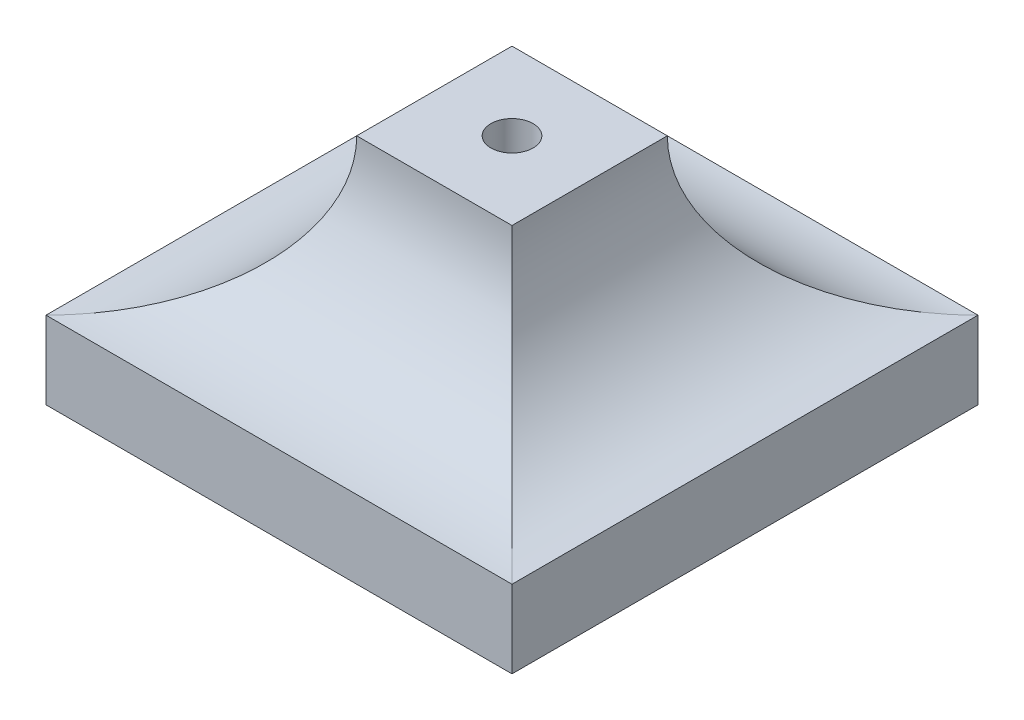
ISO-10303-21;
HEADER;
FILE_DESCRIPTION(('STEP AP214'),'2;1');
FILE_NAME('part.step','',(''),(''),'','','');
FILE_SCHEMA(('AUTOMOTIVE_DESIGN { 1 0 10303 214 1 1 1 1 }'));
ENDSEC;
DATA;
#1=APPLICATION_CONTEXT('core data for automotive mechanical design processes');
#2=APPLICATION_PROTOCOL_DEFINITION('international standard','automotive_design',2000,#1);
#3=PRODUCT_CONTEXT('',#1,'mechanical');
#4=PRODUCT('Part','Part','',(#3));
#5=PRODUCT_RELATED_PRODUCT_CATEGORY('part','',(#4));
#6=PRODUCT_DEFINITION_FORMATION('','',#4);
#7=PRODUCT_DEFINITION_CONTEXT('part definition',#1,'design');
#8=PRODUCT_DEFINITION('design','',#6,#7);
#9=PRODUCT_DEFINITION_SHAPE('','',#8);
#10=(LENGTH_UNIT() NAMED_UNIT(*) SI_UNIT(.MILLI.,.METRE.));
#11=(NAMED_UNIT(*) PLANE_ANGLE_UNIT() SI_UNIT($,.RADIAN.));
#12=(NAMED_UNIT(*) SI_UNIT($,.STERADIAN.) SOLID_ANGLE_UNIT());
#13=UNCERTAINTY_MEASURE_WITH_UNIT(LENGTH_MEASURE(1.E-05),#10,'distance_accuracy_value','');
#14=(GEOMETRIC_REPRESENTATION_CONTEXT(3) GLOBAL_UNCERTAINTY_ASSIGNED_CONTEXT((#13)) GLOBAL_UNIT_ASSIGNED_CONTEXT((#10,
#11,#12)) REPRESENTATION_CONTEXT('',''));
#15=CARTESIAN_POINT('',(0.,0.,0.));
#16=DIRECTION('',(0.,0.,1.));
#17=DIRECTION('',(1.,0.,0.));
#18=AXIS2_PLACEMENT_3D('',#15,#16,#17);
#19=CARTESIAN_POINT('',(0.,19.0499998008095,0.));
#20=DIRECTION('',(0.,1.,0.));
#21=DIRECTION('',(0.,0.,1.));
#22=AXIS2_PLACEMENT_3D('',#19,#20,#21);
#23=CYLINDRICAL_SURFACE('',#22,1.7272);
#24=CARTESIAN_POINT('',(0.,19.0499998008095,0.));
#25=DIRECTION('',(0.,1.,0.));
#26=DIRECTION('',(0.,0.,1.));
#27=AXIS2_PLACEMENT_3D('',#24,#25,#26);
#28=CIRCLE('',#27,1.7272);
#29=CARTESIAN_POINT('',(0.,19.0499998008095,1.7272));
#30=VERTEX_POINT('',#29);
#31=EDGE_CURVE('E127',#30,#30,#28,.T.);
#32=ORIENTED_EDGE('',*,*,#31,.T.);
#33=EDGE_LOOP('',(#32));
#34=FACE_BOUND('',#33,.T.);
#35=CARTESIAN_POINT('',(0.,6.35,0.));
#36=DIRECTION('',(0.,-1.,0.));
#37=DIRECTION('',(0.,0.,-1.));
#38=AXIS2_PLACEMENT_3D('',#35,#36,#37);
#39=CIRCLE('',#38,1.7272);
#40=CARTESIAN_POINT('',(0.,6.35,-1.7272));
#41=VERTEX_POINT('',#40);
#42=EDGE_CURVE('E38',#41,#41,#39,.F.);
#43=ORIENTED_EDGE('',*,*,#42,.F.);
#44=EDGE_LOOP('',(#43));
#45=FACE_BOUND('',#44,.T.);
#46=ADVANCED_FACE('F34',(#34,#45),#23,.F.);
#47=CARTESIAN_POINT('',(19.05,6.35,-19.05));
#48=DIRECTION('',(-1.,0.,0.));
#49=DIRECTION('',(0.,0.,1.));
#50=AXIS2_PLACEMENT_3D('',#47,#48,#49);
#51=PLANE('',#50);
#52=DIRECTION('',(0.,0.,-1.));
#53=VECTOR('',#52,1.);
#54=CARTESIAN_POINT('',(19.05,0.,-19.05));
#55=LINE('',#54,#53);
#56=CARTESIAN_POINT('',(19.05,0.,19.05));
#57=VERTEX_POINT('',#56);
#58=CARTESIAN_POINT('',(19.05,0.,-19.05));
#59=VERTEX_POINT('',#58);
#60=EDGE_CURVE('E100',#57,#59,#55,.T.);
#61=ORIENTED_EDGE('',*,*,#60,.T.);
#62=DIRECTION('',(0.,-1.,0.));
#63=VECTOR('',#62,1.);
#64=CARTESIAN_POINT('',(19.05,6.35,-19.05));
#65=LINE('',#64,#63);
#66=CARTESIAN_POINT('',(19.05,6.35,-19.05));
#67=VERTEX_POINT('',#66);
#68=EDGE_CURVE('E110',#67,#59,#65,.T.);
#69=ORIENTED_EDGE('',*,*,#68,.F.);
#70=DIRECTION('',(0.,0.,-1.));
#71=VECTOR('',#70,1.);
#72=CARTESIAN_POINT('',(19.05,6.35,-19.05));
#73=LINE('',#72,#71);
#74=CARTESIAN_POINT('',(19.05,6.35,19.05));
#75=VERTEX_POINT('',#74);
#76=EDGE_CURVE('E101',#75,#67,#73,.T.);
#77=ORIENTED_EDGE('',*,*,#76,.F.);
#78=DIRECTION('',(0.,-1.,0.));
#79=VECTOR('',#78,1.);
#80=CARTESIAN_POINT('',(19.05,6.35,19.05));
#81=LINE('',#80,#79);
#82=EDGE_CURVE('E95',#75,#57,#81,.T.);
#83=ORIENTED_EDGE('',*,*,#82,.T.);
#84=EDGE_LOOP('',(#61,#69,#77,#83));
#85=FACE_BOUND('',#84,.T.);
#86=ADVANCED_FACE('F36',(#85),#51,.F.);
#87=CARTESIAN_POINT('',(-19.05,6.35,-19.05));
#88=DIRECTION('',(0.,0.,1.));
#89=DIRECTION('',(1.,0.,0.));
#90=AXIS2_PLACEMENT_3D('',#87,#88,#89);
#91=PLANE('',#90);
#92=DIRECTION('',(0.,-1.,0.));
#93=VECTOR('',#92,1.);
#94=CARTESIAN_POINT('',(-19.05,6.35,-19.05));
#95=LINE('',#94,#93);
#96=CARTESIAN_POINT('',(-19.05,6.35,-19.05));
#97=VERTEX_POINT('',#96);
#98=CARTESIAN_POINT('',(-19.05,0.,-19.05));
#99=VERTEX_POINT('',#98);
#100=EDGE_CURVE('E85',#97,#99,#95,.T.);
#101=ORIENTED_EDGE('',*,*,#100,.F.);
#102=DIRECTION('',(1.,0.,0.));
#103=VECTOR('',#102,1.);
#104=CARTESIAN_POINT('',(-19.05,6.35,-19.05));
#105=LINE('',#104,#103);
#106=EDGE_CURVE('E118',#97,#67,#105,.T.);
#107=ORIENTED_EDGE('',*,*,#106,.T.);
#108=ORIENTED_EDGE('',*,*,#68,.T.);
#109=DIRECTION('',(-1.,0.,0.));
#110=VECTOR('',#109,1.);
#111=CARTESIAN_POINT('',(-19.05,0.,-19.05));
#112=LINE('',#111,#110);
#113=EDGE_CURVE('E89',#59,#99,#112,.T.);
#114=ORIENTED_EDGE('',*,*,#113,.T.);
#115=EDGE_LOOP('',(#101,#107,#108,#114));
#116=FACE_BOUND('',#115,.T.);
#117=ADVANCED_FACE('F126',(#116),#91,.F.);
#118=CARTESIAN_POINT('',(-19.05,6.35,-19.05));
#119=DIRECTION('',(1.,0.,0.));
#120=DIRECTION('',(0.,0.,-1.));
#121=AXIS2_PLACEMENT_3D('',#118,#119,#120);
#122=PLANE('',#121);
#123=DIRECTION('',(0.,0.,1.));
#124=VECTOR('',#123,1.);
#125=CARTESIAN_POINT('',(-19.05,0.,-19.05));
#126=LINE('',#125,#124);
#127=CARTESIAN_POINT('',(-19.05,0.,19.05));
#128=VERTEX_POINT('',#127);
#129=EDGE_CURVE('E77',#99,#128,#126,.T.);
#130=ORIENTED_EDGE('',*,*,#129,.T.);
#131=DIRECTION('',(0.,-1.,0.));
#132=VECTOR('',#131,1.);
#133=CARTESIAN_POINT('',(-19.05,6.35,19.05));
#134=LINE('',#133,#132);
#135=CARTESIAN_POINT('',(-19.05,6.35,19.05));
#136=VERTEX_POINT('',#135);
#137=EDGE_CURVE('E82',#136,#128,#134,.T.);
#138=ORIENTED_EDGE('',*,*,#137,.F.);
#139=DIRECTION('',(0.,0.,1.));
#140=VECTOR('',#139,1.);
#141=CARTESIAN_POINT('',(-19.05,6.35,-19.05));
#142=LINE('',#141,#140);
#143=EDGE_CURVE('E104',#97,#136,#142,.T.);
#144=ORIENTED_EDGE('',*,*,#143,.F.);
#145=ORIENTED_EDGE('',*,*,#100,.T.);
#146=EDGE_LOOP('',(#130,#138,#144,#145));
#147=FACE_BOUND('',#146,.T.);
#148=ADVANCED_FACE('F79',(#147),#122,.F.);
#149=CARTESIAN_POINT('',(-19.05,6.35,19.05));
#150=DIRECTION('',(0.,0.,-1.));
#151=DIRECTION('',(-1.,0.,0.));
#152=AXIS2_PLACEMENT_3D('',#149,#150,#151);
#153=PLANE('',#152);
#154=ORIENTED_EDGE('',*,*,#82,.F.);
#155=DIRECTION('',(1.,0.,0.));
#156=VECTOR('',#155,1.);
#157=CARTESIAN_POINT('',(-19.05,6.35,19.05));
#158=LINE('',#157,#156);
#159=EDGE_CURVE('E58',#136,#75,#158,.T.);
#160=ORIENTED_EDGE('',*,*,#159,.F.);
#161=ORIENTED_EDGE('',*,*,#137,.T.);
#162=DIRECTION('',(1.,0.,0.));
#163=VECTOR('',#162,1.);
#164=CARTESIAN_POINT('',(-19.05,0.,19.05));
#165=LINE('',#164,#163);
#166=EDGE_CURVE('E88',#128,#57,#165,.T.);
#167=ORIENTED_EDGE('',*,*,#166,.T.);
#168=EDGE_LOOP('',(#154,#160,#161,#167));
#169=FACE_BOUND('',#168,.T.);
#170=ADVANCED_FACE('F93',(#169),#153,.F.);
#171=CARTESIAN_POINT('',(0.,0.,0.));
#172=DIRECTION('',(0.,1.,0.));
#173=DIRECTION('',(0.,0.,1.));
#174=AXIS2_PLACEMENT_3D('',#171,#172,#173);
#175=PLANE('',#174);
#176=CARTESIAN_POINT('',(0.,0.,0.));
#177=DIRECTION('',(0.,-1.,0.));
#178=DIRECTION('',(0.,0.,-1.));
#179=AXIS2_PLACEMENT_3D('',#176,#177,#178);
#180=CIRCLE('',#179,3.96875);
#181=CARTESIAN_POINT('',(0.,0.,-3.96875));
#182=VERTEX_POINT('',#181);
#183=EDGE_CURVE('E285',#182,#182,#180,.T.);
#184=ORIENTED_EDGE('',*,*,#183,.F.);
#185=EDGE_LOOP('',(#184));
#186=FACE_BOUND('',#185,.T.);
#187=ORIENTED_EDGE('',*,*,#60,.F.);
#188=ORIENTED_EDGE('',*,*,#166,.F.);
#189=ORIENTED_EDGE('',*,*,#129,.F.);
#190=ORIENTED_EDGE('',*,*,#113,.F.);
#191=EDGE_LOOP('',(#187,#188,#189,#190));
#192=FACE_BOUND('',#191,.T.);
#193=ADVANCED_FACE('F98',(#186,#192),#175,.F.);
#194=CARTESIAN_POINT('',(-19.05,19.0499998008095,-59.2109262211489));
#195=DIRECTION('',(0.,0.,1.));
#196=DIRECTION('',(1.,0.,0.));
#197=AXIS2_PLACEMENT_3D('',#194,#195,#196);
#198=CYLINDRICAL_SURFACE('',#197,12.6999998008095);
#199=CARTESIAN_POINT('',(-19.05,19.0499998008095,19.05));
#200=DIRECTION('',(0.707106781186548,0.,0.707106781186547));
#201=DIRECTION('',(-0.707106781186547,0.,0.707106781186547));
#202=AXIS2_PLACEMENT_3D('',#199,#200,#201);
#203=ELLIPSE('',#202,17.9605119604404,12.6999998008095);
#204=CARTESIAN_POINT('',(-6.35000019919047,19.0499998008095,6.35000019919048));
#205=VERTEX_POINT('',#204);
#206=EDGE_CURVE('E151',#205,#136,#203,.F.);
#207=ORIENTED_EDGE('',*,*,#206,.F.);
#208=DIRECTION('',(0.,0.,1.));
#209=VECTOR('',#208,1.);
#210=CARTESIAN_POINT('',(-6.35000019919047,19.0499998008095,-59.2109262211489));
#211=LINE('',#210,#209);
#212=CARTESIAN_POINT('',(-6.35000019919047,19.0499998008095,-6.35000019919048));
#213=VERTEX_POINT('',#212);
#214=EDGE_CURVE('E143',#213,#205,#211,.T.);
#215=ORIENTED_EDGE('',*,*,#214,.F.);
#216=CARTESIAN_POINT('',(-19.05,19.0499998008095,-19.05));
#217=DIRECTION('',(-0.707106781186547,0.,0.707106781186547));
#218=DIRECTION('',(0.707106781186548,0.,0.707106781186547));
#219=AXIS2_PLACEMENT_3D('',#216,#217,#218);
#220=ELLIPSE('',#219,17.9605119604404,12.6999998008095);
#221=EDGE_CURVE('E145',#97,#213,#220,.T.);
#222=ORIENTED_EDGE('',*,*,#221,.F.);
#223=ORIENTED_EDGE('',*,*,#143,.T.);
#224=EDGE_LOOP('',(#207,#215,#222,#223));
#225=FACE_BOUND('',#224,.T.);
#226=ADVANCED_FACE('F157',(#225),#198,.F.);
#227=CARTESIAN_POINT('',(-6.35000019919047,19.0499998008095,-59.2109262211489));
#228=DIRECTION('',(0.,1.,0.));
#229=DIRECTION('',(0.,0.,1.));
#230=AXIS2_PLACEMENT_3D('',#227,#228,#229);
#231=PLANE('',#230);
#232=ORIENTED_EDGE('',*,*,#31,.F.);
#233=EDGE_LOOP('',(#232));
#234=FACE_BOUND('',#233,.T.);
#235=DIRECTION('',(1.,0.,0.));
#236=VECTOR('',#235,1.);
#237=CARTESIAN_POINT('',(-19.05,19.0499998008095,6.35000019919048));
#238=LINE('',#237,#236);
#239=CARTESIAN_POINT('',(6.34999980080952,19.0499998008095,6.35000019919048));
#240=VERTEX_POINT('',#239);
#241=EDGE_CURVE('E137',#205,#240,#238,.T.);
#242=ORIENTED_EDGE('',*,*,#241,.T.);
#243=DIRECTION('',(0.,0.,1.));
#244=VECTOR('',#243,1.);
#245=CARTESIAN_POINT('',(6.34999980080952,19.0499998008095,-59.2109262211489));
#246=LINE('',#245,#244);
#247=CARTESIAN_POINT('',(6.34999980080952,19.0499998008095,-6.35000019919049));
#248=VERTEX_POINT('',#247);
#249=EDGE_CURVE('E132',#248,#240,#246,.T.);
#250=ORIENTED_EDGE('',*,*,#249,.F.);
#251=DIRECTION('',(1.,0.,0.));
#252=VECTOR('',#251,1.);
#253=CARTESIAN_POINT('',(-19.05,19.0499998008095,-6.35000019919047));
#254=LINE('',#253,#252);
#255=EDGE_CURVE('E50',#213,#248,#254,.T.);
#256=ORIENTED_EDGE('',*,*,#255,.F.);
#257=ORIENTED_EDGE('',*,*,#214,.T.);
#258=EDGE_LOOP('',(#242,#250,#256,#257));
#259=FACE_BOUND('',#258,.T.);
#260=ADVANCED_FACE('F141',(#234,#259),#231,.T.);
#261=CARTESIAN_POINT('',(19.049999601619,19.0499998008095,-59.2109262211489));
#262=DIRECTION('',(0.,0.,1.));
#263=DIRECTION('',(1.,0.,0.));
#264=AXIS2_PLACEMENT_3D('',#261,#262,#263);
#265=CYLINDRICAL_SURFACE('',#264,12.6999998008095);
#266=CARTESIAN_POINT('',(19.049999601619,19.0499998008095,19.05));
#267=DIRECTION('',(-0.707106781186547,0.,0.707106781186547));
#268=DIRECTION('',(0.707106781186548,0.,0.707106781186547));
#269=AXIS2_PLACEMENT_3D('',#266,#267,#268);
#270=ELLIPSE('',#269,17.9605119604404,12.6999998008095);
#271=EDGE_CURVE('E11',#75,#240,#270,.F.);
#272=ORIENTED_EDGE('',*,*,#271,.F.);
#273=ORIENTED_EDGE('',*,*,#76,.T.);
#274=CARTESIAN_POINT('',(19.049999601619,19.0499998008095,-19.05));
#275=DIRECTION('',(0.707106781186548,0.,0.707106781186547));
#276=DIRECTION('',(-0.707106781186547,0.,0.707106781186547));
#277=AXIS2_PLACEMENT_3D('',#274,#275,#276);
#278=ELLIPSE('',#277,17.9605119604404,12.6999998008095);
#279=EDGE_CURVE('E43',#248,#67,#278,.T.);
#280=ORIENTED_EDGE('',*,*,#279,.F.);
#281=ORIENTED_EDGE('',*,*,#249,.T.);
#282=EDGE_LOOP('',(#272,#273,#280,#281));
#283=FACE_BOUND('',#282,.T.);
#284=ADVANCED_FACE('F131',(#283),#265,.F.);
#285=CARTESIAN_POINT('',(-19.05,19.0499998008095,-19.05));
#286=DIRECTION('',(1.,0.,0.));
#287=DIRECTION('',(0.,0.,-1.));
#288=AXIS2_PLACEMENT_3D('',#285,#286,#287);
#289=CYLINDRICAL_SURFACE('',#288,12.6999998008095);
#290=ORIENTED_EDGE('',*,*,#221,.T.);
#291=ORIENTED_EDGE('',*,*,#255,.T.);
#292=ORIENTED_EDGE('',*,*,#279,.T.);
#293=ORIENTED_EDGE('',*,*,#106,.F.);
#294=EDGE_LOOP('',(#290,#291,#292,#293));
#295=FACE_BOUND('',#294,.T.);
#296=ADVANCED_FACE('F116',(#295),#289,.F.);
#297=CARTESIAN_POINT('',(-19.05,19.0499998008095,19.05));
#298=DIRECTION('',(1.,0.,0.));
#299=DIRECTION('',(0.,0.,-1.));
#300=AXIS2_PLACEMENT_3D('',#297,#298,#299);
#301=CYLINDRICAL_SURFACE('',#300,12.6999998008095);
#302=ORIENTED_EDGE('',*,*,#206,.T.);
#303=ORIENTED_EDGE('',*,*,#159,.T.);
#304=ORIENTED_EDGE('',*,*,#271,.T.);
#305=ORIENTED_EDGE('',*,*,#241,.F.);
#306=EDGE_LOOP('',(#302,#303,#304,#305));
#307=FACE_BOUND('',#306,.T.);
#308=ADVANCED_FACE('F135',(#307),#301,.F.);
#309=CARTESIAN_POINT('',(0.,6.35,0.));
#310=DIRECTION('',(0.,-1.,0.));
#311=DIRECTION('',(0.,0.,-1.));
#312=AXIS2_PLACEMENT_3D('',#309,#310,#311);
#313=PLANE('',#312);
#314=CARTESIAN_POINT('',(0.,6.35,0.));
#315=DIRECTION('',(0.,-1.,0.));
#316=DIRECTION('',(0.,0.,-1.));
#317=AXIS2_PLACEMENT_3D('',#314,#315,#316);
#318=CIRCLE('',#317,3.96875);
#319=CARTESIAN_POINT('',(0.,6.35,-3.96875));
#320=VERTEX_POINT('',#319);
#321=EDGE_CURVE('E282',#320,#320,#318,.T.);
#322=ORIENTED_EDGE('',*,*,#321,.T.);
#323=EDGE_LOOP('',(#322));
#324=FACE_BOUND('',#323,.T.);
#325=ORIENTED_EDGE('',*,*,#42,.T.);
#326=EDGE_LOOP('',(#325));
#327=FACE_BOUND('',#326,.T.);
#328=ADVANCED_FACE('F187',(#324,#327),#313,.T.);
#329=CARTESIAN_POINT('',(0.,6.35,0.));
#330=DIRECTION('',(0.,-1.,0.));
#331=DIRECTION('',(0.,0.,-1.));
#332=AXIS2_PLACEMENT_3D('',#329,#330,#331);
#333=CYLINDRICAL_SURFACE('',#332,3.96875);
#334=ORIENTED_EDGE('',*,*,#321,.F.);
#335=EDGE_LOOP('',(#334));
#336=FACE_BOUND('',#335,.T.);
#337=ORIENTED_EDGE('',*,*,#183,.T.);
#338=EDGE_LOOP('',(#337));
#339=FACE_BOUND('',#338,.T.);
#340=ADVANCED_FACE('F183',(#336,#339),#333,.F.);
#341=CLOSED_SHELL('',(#46,#86,#117,#148,#170,#193,#226,#260,#284,#296,#308,#328,#340));
#342=MANIFOLD_SOLID_BREP('B2',#341);
#343=ADVANCED_BREP_SHAPE_REPRESENTATION('',(#18,#342),#14);
#344=SHAPE_DEFINITION_REPRESENTATION(#9,#343);
ENDSEC;
END-ISO-10303-21;
